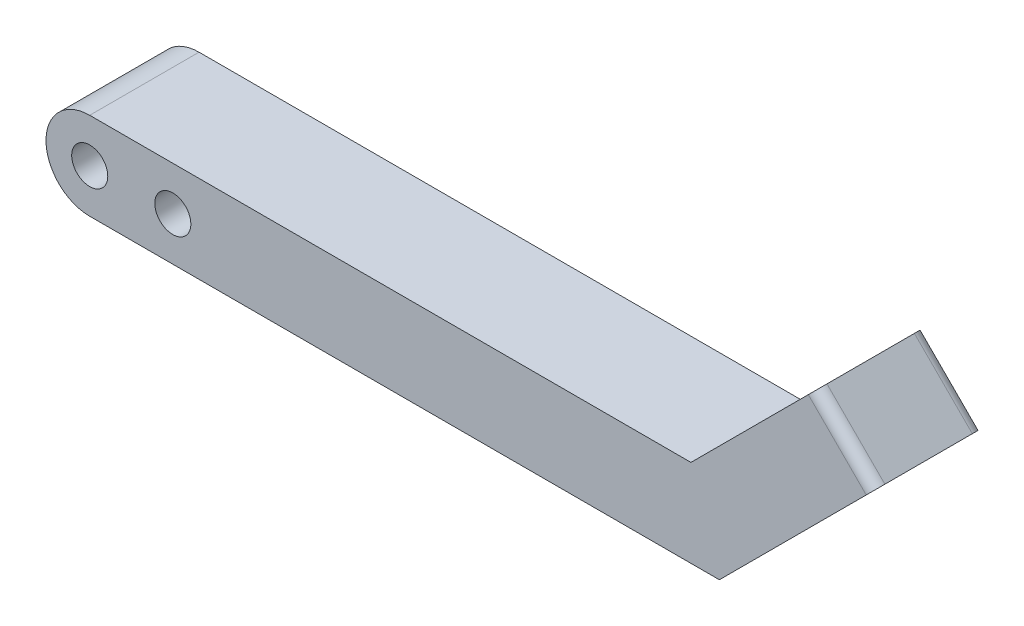
ISO-10303-21;
HEADER;
FILE_DESCRIPTION(('STEP AP214'),'2;1');
FILE_NAME('part.step','',(''),(''),'','','');
FILE_SCHEMA(('AUTOMOTIVE_DESIGN { 1 0 10303 214 1 1 1 1 }'));
ENDSEC;
DATA;
#1=APPLICATION_CONTEXT('core data for automotive mechanical design processes');
#2=APPLICATION_PROTOCOL_DEFINITION('international standard','automotive_design',2000,#1);
#3=PRODUCT_CONTEXT('',#1,'mechanical');
#4=PRODUCT('Part','Part','',(#3));
#5=PRODUCT_RELATED_PRODUCT_CATEGORY('part','',(#4));
#6=PRODUCT_DEFINITION_FORMATION('','',#4);
#7=PRODUCT_DEFINITION_CONTEXT('part definition',#1,'design');
#8=PRODUCT_DEFINITION('design','',#6,#7);
#9=PRODUCT_DEFINITION_SHAPE('','',#8);
#10=(LENGTH_UNIT() NAMED_UNIT(*) SI_UNIT(.MILLI.,.METRE.));
#11=(NAMED_UNIT(*) PLANE_ANGLE_UNIT() SI_UNIT($,.RADIAN.));
#12=(NAMED_UNIT(*) SI_UNIT($,.STERADIAN.) SOLID_ANGLE_UNIT());
#13=UNCERTAINTY_MEASURE_WITH_UNIT(LENGTH_MEASURE(1.E-05),#10,'distance_accuracy_value','');
#14=(GEOMETRIC_REPRESENTATION_CONTEXT(3) GLOBAL_UNCERTAINTY_ASSIGNED_CONTEXT((#13)) GLOBAL_UNIT_ASSIGNED_CONTEXT((#10,
#11,#12)) REPRESENTATION_CONTEXT('',''));
#15=CARTESIAN_POINT('',(0.,0.,0.));
#16=DIRECTION('',(0.,0.,1.));
#17=DIRECTION('',(1.,0.,0.));
#18=AXIS2_PLACEMENT_3D('',#15,#16,#17);
#19=CARTESIAN_POINT('',(0.,4.17914078800926,10.));
#20=DIRECTION('',(0.,1.,0.));
#21=DIRECTION('',(-1.,0.,0.));
#22=AXIS2_PLACEMENT_3D('',#19,#20,#21);
#23=PLANE('',#22);
#24=DIRECTION('',(1.,0.,0.));
#25=VECTOR('',#24,1.);
#26=CARTESIAN_POINT('',(0.,4.17914078800926,0.));
#27=LINE('',#26,#25);
#28=CARTESIAN_POINT('',(-42.3111456159876,4.17914078800927,0.));
#29=VERTEX_POINT('',#28);
#30=CARTESIAN_POINT('',(12.6888543840124,4.17914078800926,0.));
#31=VERTEX_POINT('',#30);
#32=EDGE_CURVE('E110',#29,#31,#27,.T.);
#33=ORIENTED_EDGE('',*,*,#32,.F.);
#34=DIRECTION('',(0.,0.,-1.));
#35=VECTOR('',#34,1.);
#36=CARTESIAN_POINT('',(-42.3111456159876,4.17914078800927,10.));
#37=LINE('',#36,#35);
#38=CARTESIAN_POINT('',(-42.3111456159876,4.17914078800927,10.));
#39=VERTEX_POINT('',#38);
#40=EDGE_CURVE('E104',#39,#29,#37,.T.);
#41=ORIENTED_EDGE('',*,*,#40,.F.);
#42=DIRECTION('',(1.,0.,0.));
#43=VECTOR('',#42,1.);
#44=CARTESIAN_POINT('',(0.,4.17914078800926,10.));
#45=LINE('',#44,#43);
#46=CARTESIAN_POINT('',(12.6888543840124,4.17914078800926,10.));
#47=VERTEX_POINT('',#46);
#48=EDGE_CURVE('E107',#39,#47,#45,.T.);
#49=ORIENTED_EDGE('',*,*,#48,.T.);
#50=DIRECTION('',(0.,0.,-1.));
#51=VECTOR('',#50,1.);
#52=CARTESIAN_POINT('',(12.6888543840124,4.17914078800926,10.));
#53=LINE('',#52,#51);
#54=EDGE_CURVE('E144',#47,#31,#53,.T.);
#55=ORIENTED_EDGE('',*,*,#54,.T.);
#56=EDGE_LOOP('',(#33,#41,#49,#55));
#57=FACE_BOUND('',#56,.T.);
#58=ADVANCED_FACE('F37',(#57),#23,.T.);
#59=CARTESIAN_POINT('',(-42.3111456159876,0.179140788009263,10.));
#60=DIRECTION('',(0.,0.,-1.));
#61=DIRECTION('',(-1.,0.,0.));
#62=AXIS2_PLACEMENT_3D('',#59,#60,#61);
#63=CYLINDRICAL_SURFACE('',#62,4.00000000000001);
#64=CARTESIAN_POINT('',(-42.3111456159876,0.179140788009263,0.));
#65=DIRECTION('',(0.,0.,1.));
#66=DIRECTION('',(1.,0.,0.));
#67=AXIS2_PLACEMENT_3D('',#64,#65,#66);
#68=CIRCLE('',#67,4.00000000000001);
#69=CARTESIAN_POINT('',(-42.3111456159876,-3.82085921199074,0.));
#70=VERTEX_POINT('',#69);
#71=EDGE_CURVE('E150',#29,#70,#68,.T.);
#72=ORIENTED_EDGE('',*,*,#71,.T.);
#73=DIRECTION('',(0.,0.,-1.));
#74=VECTOR('',#73,1.);
#75=CARTESIAN_POINT('',(-42.3111456159876,-3.82085921199074,10.));
#76=LINE('',#75,#74);
#77=CARTESIAN_POINT('',(-42.3111456159876,-3.82085921199074,10.));
#78=VERTEX_POINT('',#77);
#79=EDGE_CURVE('E115',#78,#70,#76,.T.);
#80=ORIENTED_EDGE('',*,*,#79,.F.);
#81=CARTESIAN_POINT('',(-42.3111456159876,0.179140788009263,10.));
#82=DIRECTION('',(0.,0.,1.));
#83=DIRECTION('',(1.,0.,0.));
#84=AXIS2_PLACEMENT_3D('',#81,#82,#83);
#85=CIRCLE('',#84,4.00000000000001);
#86=EDGE_CURVE('E119',#39,#78,#85,.T.);
#87=ORIENTED_EDGE('',*,*,#86,.F.);
#88=ORIENTED_EDGE('',*,*,#40,.T.);
#89=EDGE_LOOP('',(#72,#80,#87,#88));
#90=FACE_BOUND('',#89,.T.);
#91=ADVANCED_FACE('F120',(#90),#63,.T.);
#92=CARTESIAN_POINT('',(0.,-3.82085921199074,10.));
#93=DIRECTION('',(0.,1.,0.));
#94=DIRECTION('',(0.,0.,1.));
#95=AXIS2_PLACEMENT_3D('',#92,#93,#94);
#96=PLANE('',#95);
#97=DIRECTION('',(1.,0.,0.));
#98=VECTOR('',#97,1.);
#99=CARTESIAN_POINT('',(0.,-3.82085921199074,0.));
#100=LINE('',#99,#98);
#101=CARTESIAN_POINT('',(15.2888543840124,-3.82085921199074,0.));
#102=VERTEX_POINT('',#101);
#103=EDGE_CURVE('E152',#70,#102,#100,.T.);
#104=ORIENTED_EDGE('',*,*,#103,.T.);
#105=DIRECTION('',(0.,0.,-1.));
#106=VECTOR('',#105,1.);
#107=CARTESIAN_POINT('',(15.2888543840124,-3.82085921199074,10.));
#108=LINE('',#107,#106);
#109=CARTESIAN_POINT('',(15.2888543840124,-3.82085921199074,10.));
#110=VERTEX_POINT('',#109);
#111=EDGE_CURVE('E168',#110,#102,#108,.T.);
#112=ORIENTED_EDGE('',*,*,#111,.F.);
#113=DIRECTION('',(1.,0.,0.));
#114=VECTOR('',#113,1.);
#115=CARTESIAN_POINT('',(0.,-3.82085921199074,10.));
#116=LINE('',#115,#114);
#117=EDGE_CURVE('E124',#78,#110,#116,.T.);
#118=ORIENTED_EDGE('',*,*,#117,.F.);
#119=ORIENTED_EDGE('',*,*,#79,.T.);
#120=EDGE_LOOP('',(#104,#112,#118,#119));
#121=FACE_BOUND('',#120,.T.);
#122=ADVANCED_FACE('F197',(#121),#96,.F.);
#123=CARTESIAN_POINT('',(9.55485679800158,-9.55485679800154,10.));
#124=DIRECTION('',(-0.707106781186549,0.707106781186546,0.));
#125=DIRECTION('',(-0.707106781186546,-0.707106781186549,0.));
#126=AXIS2_PLACEMENT_3D('',#123,#124,#125);
#127=PLANE('',#126);
#128=CARTESIAN_POINT('',(23.7099221958778,4.60020859987476,5.));
#129=DIRECTION('',(-0.707106781186549,0.707106781186546,0.));
#130=DIRECTION('',(-0.707106781186546,-0.707106781186549,0.));
#131=AXIS2_PLACEMENT_3D('',#128,#129,#130);
#132=CIRCLE('',#131,2.);
#133=CARTESIAN_POINT('',(22.2957086335047,3.18599503750166,5.));
#134=VERTEX_POINT('',#133);
#135=EDGE_CURVE('E148',#134,#134,#132,.T.);
#136=ORIENTED_EDGE('',*,*,#135,.T.);
#137=EDGE_LOOP('',(#136));
#138=FACE_BOUND('',#137,.T.);
#139=DIRECTION('',(0.707106781186546,0.707106781186549,0.));
#140=VECTOR('',#139,1.);
#141=CARTESIAN_POINT('',(9.55485679800158,-9.55485679800154,0.));
#142=LINE('',#141,#140);
#143=CARTESIAN_POINT('',(28.7238832265567,9.61416963055369,0.));
#144=VERTEX_POINT('',#143);
#145=EDGE_CURVE('E155',#102,#144,#142,.T.);
#146=ORIENTED_EDGE('',*,*,#145,.T.);
#147=CARTESIAN_POINT('',(28.7238832265567,9.6141696305537,0.999999999999999));
#148=DIRECTION('',(-0.707106781186549,0.707106781186546,0.));
#149=DIRECTION('',(-0.707106781186546,-0.707106781186549,0.));
#150=AXIS2_PLACEMENT_3D('',#147,#148,#149);
#151=CIRCLE('',#150,1.);
#152=CARTESIAN_POINT('',(29.4309900077433,10.3212764117402,0.999999999999999));
#153=VERTEX_POINT('',#152);
#154=EDGE_CURVE('E45',#144,#153,#151,.F.);
#155=ORIENTED_EDGE('',*,*,#154,.T.);
#156=DIRECTION('',(0.,0.,-1.));
#157=VECTOR('',#156,1.);
#158=CARTESIAN_POINT('',(29.4309900077433,10.3212764117402,10.));
#159=LINE('',#158,#157);
#160=CARTESIAN_POINT('',(29.4309900077433,10.3212764117402,9.));
#161=VERTEX_POINT('',#160);
#162=EDGE_CURVE('E165',#161,#153,#159,.T.);
#163=ORIENTED_EDGE('',*,*,#162,.F.);
#164=CARTESIAN_POINT('',(28.7238832265567,9.6141696305537,9.));
#165=DIRECTION('',(-0.707106781186549,0.707106781186546,0.));
#166=DIRECTION('',(-0.707106781186546,-0.707106781186549,0.));
#167=AXIS2_PLACEMENT_3D('',#164,#165,#166);
#168=CIRCLE('',#167,1.);
#169=CARTESIAN_POINT('',(28.7238832265567,9.6141696305537,10.));
#170=VERTEX_POINT('',#169);
#171=EDGE_CURVE('E52',#161,#170,#168,.F.);
#172=ORIENTED_EDGE('',*,*,#171,.T.);
#173=DIRECTION('',(0.707106781186546,0.707106781186549,0.));
#174=VECTOR('',#173,1.);
#175=CARTESIAN_POINT('',(9.55485679800158,-9.55485679800154,10.));
#176=LINE('',#175,#174);
#177=EDGE_CURVE('E138',#110,#170,#176,.T.);
#178=ORIENTED_EDGE('',*,*,#177,.F.);
#179=ORIENTED_EDGE('',*,*,#111,.T.);
#180=EDGE_LOOP('',(#146,#155,#163,#172,#178,#179));
#181=FACE_BOUND('',#180,.T.);
#182=ADVANCED_FACE('F182',(#138,#181),#127,.F.);
#183=CARTESIAN_POINT('',(19.8761332097417,19.8761332097418,10.));
#184=DIRECTION('',(-0.707106781186546,-0.707106781186549,0.));
#185=DIRECTION('',(0.707106781186549,-0.707106781186546,0.));
#186=AXIS2_PLACEMENT_3D('',#183,#184,#185);
#187=PLANE('',#186);
#188=ORIENTED_EDGE('',*,*,#162,.T.);
#189=DIRECTION('',(-0.707106781186549,0.707106781186546,0.));
#190=VECTOR('',#189,1.);
#191=CARTESIAN_POINT('',(19.8761332097417,19.8761332097418,0.999999999999999));
#192=LINE('',#191,#190);
#193=CARTESIAN_POINT('',(24.1309900077433,15.6212764117402,0.999999999999999));
#194=VERTEX_POINT('',#193);
#195=EDGE_CURVE('E173',#153,#194,#192,.T.);
#196=ORIENTED_EDGE('',*,*,#195,.T.);
#197=DIRECTION('',(0.,0.,-1.));
#198=VECTOR('',#197,1.);
#199=CARTESIAN_POINT('',(24.1309900077433,15.6212764117402,10.));
#200=LINE('',#199,#198);
#201=CARTESIAN_POINT('',(24.1309900077433,15.6212764117402,9.));
#202=VERTEX_POINT('',#201);
#203=EDGE_CURVE('E162',#202,#194,#200,.T.);
#204=ORIENTED_EDGE('',*,*,#203,.F.);
#205=DIRECTION('',(-0.707106781186549,0.707106781186546,0.));
#206=VECTOR('',#205,1.);
#207=CARTESIAN_POINT('',(29.4309900077433,10.3212764117402,9.));
#208=LINE('',#207,#206);
#209=EDGE_CURVE('E114',#202,#161,#208,.F.);
#210=ORIENTED_EDGE('',*,*,#209,.T.);
#211=EDGE_LOOP('',(#188,#196,#204,#210));
#212=FACE_BOUND('',#211,.T.);
#213=ADVANCED_FACE('F186',(#212),#187,.F.);
#214=CARTESIAN_POINT('',(4.25485679800157,-4.25485679800156,10.));
#215=DIRECTION('',(-0.707106781186549,0.707106781186546,0.));
#216=DIRECTION('',(-0.707106781186546,-0.707106781186549,0.));
#217=AXIS2_PLACEMENT_3D('',#214,#215,#216);
#218=PLANE('',#217);
#219=CARTESIAN_POINT('',(18.4099221958778,9.90020859987474,5.));
#220=DIRECTION('',(-0.707106781186549,0.707106781186546,0.));
#221=DIRECTION('',(-0.707106781186546,-0.707106781186549,0.));
#222=AXIS2_PLACEMENT_3D('',#219,#220,#221);
#223=CIRCLE('',#222,2.);
#224=CARTESIAN_POINT('',(16.9957086335047,8.48599503750164,5.));
#225=VERTEX_POINT('',#224);
#226=EDGE_CURVE('E324',#225,#225,#223,.T.);
#227=ORIENTED_EDGE('',*,*,#226,.F.);
#228=EDGE_LOOP('',(#227));
#229=FACE_BOUND('',#228,.T.);
#230=ORIENTED_EDGE('',*,*,#203,.T.);
#231=CARTESIAN_POINT('',(23.4238832265567,14.9141696305537,0.999999999999999));
#232=DIRECTION('',(-0.707106781186549,0.707106781186546,0.));
#233=DIRECTION('',(-0.707106781186546,-0.707106781186549,0.));
#234=AXIS2_PLACEMENT_3D('',#231,#232,#233);
#235=CIRCLE('',#234,1.);
#236=CARTESIAN_POINT('',(23.4238832265567,14.9141696305537,0.));
#237=VERTEX_POINT('',#236);
#238=EDGE_CURVE('E178',#194,#237,#235,.T.);
#239=ORIENTED_EDGE('',*,*,#238,.T.);
#240=DIRECTION('',(0.707106781186546,0.707106781186549,0.));
#241=VECTOR('',#240,1.);
#242=CARTESIAN_POINT('',(4.25485679800157,-4.25485679800156,0.));
#243=LINE('',#242,#241);
#244=EDGE_CURVE('E157',#31,#237,#243,.T.);
#245=ORIENTED_EDGE('',*,*,#244,.F.);
#246=ORIENTED_EDGE('',*,*,#54,.F.);
#247=DIRECTION('',(0.707106781186546,0.707106781186549,0.));
#248=VECTOR('',#247,1.);
#249=CARTESIAN_POINT('',(4.25485679800157,-4.25485679800156,10.));
#250=LINE('',#249,#248);
#251=CARTESIAN_POINT('',(23.4238832265567,14.9141696305537,10.));
#252=VERTEX_POINT('',#251);
#253=EDGE_CURVE('E129',#47,#252,#250,.T.);
#254=ORIENTED_EDGE('',*,*,#253,.T.);
#255=CARTESIAN_POINT('',(23.4238832265567,14.9141696305537,9.));
#256=DIRECTION('',(-0.707106781186549,0.707106781186546,0.));
#257=DIRECTION('',(-0.707106781186546,-0.707106781186549,0.));
#258=AXIS2_PLACEMENT_3D('',#255,#256,#257);
#259=CIRCLE('',#258,1.);
#260=EDGE_CURVE('E176',#252,#202,#259,.T.);
#261=ORIENTED_EDGE('',*,*,#260,.T.);
#262=EDGE_LOOP('',(#230,#239,#245,#246,#254,#261));
#263=FACE_BOUND('',#262,.T.);
#264=ADVANCED_FACE('F192',(#229,#263),#218,.T.);
#265=CARTESIAN_POINT('',(-34.7111456159876,0.179140788009263,10.));
#266=DIRECTION('',(0.,0.,-1.));
#267=DIRECTION('',(-1.,0.,0.));
#268=AXIS2_PLACEMENT_3D('',#265,#266,#267);
#269=CYLINDRICAL_SURFACE('',#268,1.65);
#270=CARTESIAN_POINT('',(-34.7111456159876,0.179140788009263,10.));
#271=DIRECTION('',(0.,0.,1.));
#272=DIRECTION('',(1.,0.,0.));
#273=AXIS2_PLACEMENT_3D('',#270,#271,#272);
#274=CIRCLE('',#273,1.65);
#275=CARTESIAN_POINT('',(-33.0611456159876,0.179140788009263,10.));
#276=VERTEX_POINT('',#275);
#277=EDGE_CURVE('E130',#276,#276,#274,.T.);
#278=ORIENTED_EDGE('',*,*,#277,.T.);
#279=EDGE_LOOP('',(#278));
#280=FACE_BOUND('',#279,.T.);
#281=CARTESIAN_POINT('',(-34.7111456159876,0.179140788009263,0.));
#282=DIRECTION('',(0.,0.,1.));
#283=DIRECTION('',(1.,0.,0.));
#284=AXIS2_PLACEMENT_3D('',#281,#282,#283);
#285=CIRCLE('',#284,1.65);
#286=CARTESIAN_POINT('',(-33.0611456159876,0.179140788009263,0.));
#287=VERTEX_POINT('',#286);
#288=EDGE_CURVE('E145',#287,#287,#285,.T.);
#289=ORIENTED_EDGE('',*,*,#288,.F.);
#290=EDGE_LOOP('',(#289));
#291=FACE_BOUND('',#290,.T.);
#292=ADVANCED_FACE('F213',(#280,#291),#269,.F.);
#293=CARTESIAN_POINT('',(-42.3111456159876,0.179140788009263,10.));
#294=DIRECTION('',(0.,0.,-1.));
#295=DIRECTION('',(-1.,0.,0.));
#296=AXIS2_PLACEMENT_3D('',#293,#294,#295);
#297=CYLINDRICAL_SURFACE('',#296,1.65);
#298=CARTESIAN_POINT('',(-42.3111456159876,0.179140788009263,10.));
#299=DIRECTION('',(0.,0.,1.));
#300=DIRECTION('',(1.,0.,0.));
#301=AXIS2_PLACEMENT_3D('',#298,#299,#300);
#302=CIRCLE('',#301,1.65);
#303=CARTESIAN_POINT('',(-40.6611456159876,0.179140788009263,10.));
#304=VERTEX_POINT('',#303);
#305=EDGE_CURVE('E141',#304,#304,#302,.T.);
#306=ORIENTED_EDGE('',*,*,#305,.T.);
#307=EDGE_LOOP('',(#306));
#308=FACE_BOUND('',#307,.T.);
#309=CARTESIAN_POINT('',(-42.3111456159876,0.179140788009263,0.));
#310=DIRECTION('',(0.,0.,1.));
#311=DIRECTION('',(1.,0.,0.));
#312=AXIS2_PLACEMENT_3D('',#309,#310,#311);
#313=CIRCLE('',#312,1.65);
#314=CARTESIAN_POINT('',(-40.6611456159876,0.179140788009263,0.));
#315=VERTEX_POINT('',#314);
#316=EDGE_CURVE('E133',#315,#315,#313,.T.);
#317=ORIENTED_EDGE('',*,*,#316,.F.);
#318=EDGE_LOOP('',(#317));
#319=FACE_BOUND('',#318,.T.);
#320=ADVANCED_FACE('F215',(#308,#319),#297,.F.);
#321=CARTESIAN_POINT('',(0.,0.,10.));
#322=DIRECTION('',(0.,0.,1.));
#323=DIRECTION('',(1.,0.,0.));
#324=AXIS2_PLACEMENT_3D('',#321,#322,#323);
#325=PLANE('',#324);
#326=ORIENTED_EDGE('',*,*,#277,.F.);
#327=EDGE_LOOP('',(#326));
#328=FACE_BOUND('',#327,.T.);
#329=ORIENTED_EDGE('',*,*,#177,.T.);
#330=DIRECTION('',(-0.707106781186549,0.707106781186546,0.));
#331=VECTOR('',#330,1.);
#332=CARTESIAN_POINT('',(23.4238832265567,14.9141696305537,10.));
#333=LINE('',#332,#331);
#334=EDGE_CURVE('E11',#170,#252,#333,.T.);
#335=ORIENTED_EDGE('',*,*,#334,.T.);
#336=ORIENTED_EDGE('',*,*,#253,.F.);
#337=ORIENTED_EDGE('',*,*,#48,.F.);
#338=ORIENTED_EDGE('',*,*,#86,.T.);
#339=ORIENTED_EDGE('',*,*,#117,.T.);
#340=EDGE_LOOP('',(#329,#335,#336,#337,#338,#339));
#341=FACE_BOUND('',#340,.T.);
#342=ORIENTED_EDGE('',*,*,#305,.F.);
#343=EDGE_LOOP('',(#342));
#344=FACE_BOUND('',#343,.T.);
#345=ADVANCED_FACE('F126',(#328,#341,#344),#325,.T.);
#346=CARTESIAN_POINT('',(0.,0.,0.));
#347=DIRECTION('',(0.,0.,1.));
#348=DIRECTION('',(1.,0.,0.));
#349=AXIS2_PLACEMENT_3D('',#346,#347,#348);
#350=PLANE('',#349);
#351=ORIENTED_EDGE('',*,*,#288,.T.);
#352=EDGE_LOOP('',(#351));
#353=FACE_BOUND('',#352,.T.);
#354=ORIENTED_EDGE('',*,*,#244,.T.);
#355=DIRECTION('',(-0.707106781186549,0.707106781186546,0.));
#356=VECTOR('',#355,1.);
#357=CARTESIAN_POINT('',(19.1690264285551,19.1690264285552,0.));
#358=LINE('',#357,#356);
#359=EDGE_CURVE('E60',#237,#144,#358,.F.);
#360=ORIENTED_EDGE('',*,*,#359,.T.);
#361=ORIENTED_EDGE('',*,*,#145,.F.);
#362=ORIENTED_EDGE('',*,*,#103,.F.);
#363=ORIENTED_EDGE('',*,*,#71,.F.);
#364=ORIENTED_EDGE('',*,*,#32,.T.);
#365=EDGE_LOOP('',(#354,#360,#361,#362,#363,#364));
#366=FACE_BOUND('',#365,.T.);
#367=ORIENTED_EDGE('',*,*,#316,.T.);
#368=EDGE_LOOP('',(#367));
#369=FACE_BOUND('',#368,.T.);
#370=ADVANCED_FACE('F193',(#353,#366,#369),#350,.F.);
#371=CARTESIAN_POINT('',(30.7809900077433,-2.47085921199071,5.));
#372=DIRECTION('',(-0.707106781186549,0.707106781186546,0.));
#373=DIRECTION('',(-0.707106781186546,-0.707106781186549,0.));
#374=AXIS2_PLACEMENT_3D('',#371,#372,#373);
#375=CYLINDRICAL_SURFACE('',#374,2.);
#376=ORIENTED_EDGE('',*,*,#226,.T.);
#377=EDGE_LOOP('',(#376));
#378=FACE_BOUND('',#377,.T.);
#379=ORIENTED_EDGE('',*,*,#135,.F.);
#380=EDGE_LOOP('',(#379));
#381=FACE_BOUND('',#380,.T.);
#382=ADVANCED_FACE('F204',(#378,#381),#375,.F.);
#383=CARTESIAN_POINT('',(19.1690264285552,19.1690264285552,0.999999999999999));
#384=DIRECTION('',(-0.707106781186549,0.707106781186546,0.));
#385=DIRECTION('',(-0.707106781186546,-0.707106781186549,0.));
#386=AXIS2_PLACEMENT_3D('',#383,#384,#385);
#387=CYLINDRICAL_SURFACE('',#386,1.);
#388=ORIENTED_EDGE('',*,*,#154,.F.);
#389=ORIENTED_EDGE('',*,*,#359,.F.);
#390=ORIENTED_EDGE('',*,*,#238,.F.);
#391=ORIENTED_EDGE('',*,*,#195,.F.);
#392=EDGE_LOOP('',(#388,#389,#390,#391));
#393=FACE_BOUND('',#392,.T.);
#394=ADVANCED_FACE('F189',(#393),#387,.T.);
#395=CARTESIAN_POINT('',(19.1690264285552,19.1690264285552,9.));
#396=DIRECTION('',(0.707106781186549,-0.707106781186546,0.));
#397=DIRECTION('',(0.707106781186546,0.707106781186549,0.));
#398=AXIS2_PLACEMENT_3D('',#395,#396,#397);
#399=CYLINDRICAL_SURFACE('',#398,1.);
#400=ORIENTED_EDGE('',*,*,#171,.F.);
#401=ORIENTED_EDGE('',*,*,#209,.F.);
#402=ORIENTED_EDGE('',*,*,#260,.F.);
#403=ORIENTED_EDGE('',*,*,#334,.F.);
#404=EDGE_LOOP('',(#400,#401,#402,#403));
#405=FACE_BOUND('',#404,.T.);
#406=ADVANCED_FACE('F39',(#405),#399,.T.);
#407=CLOSED_SHELL('',(#58,#91,#122,#182,#213,#264,#292,#320,#345,#370,#382,#394,#406));
#408=MANIFOLD_SOLID_BREP('B2',#407);
#409=ADVANCED_BREP_SHAPE_REPRESENTATION('',(#18,#408),#14);
#410=SHAPE_DEFINITION_REPRESENTATION(#9,#409);
ENDSEC;
END-ISO-10303-21;
